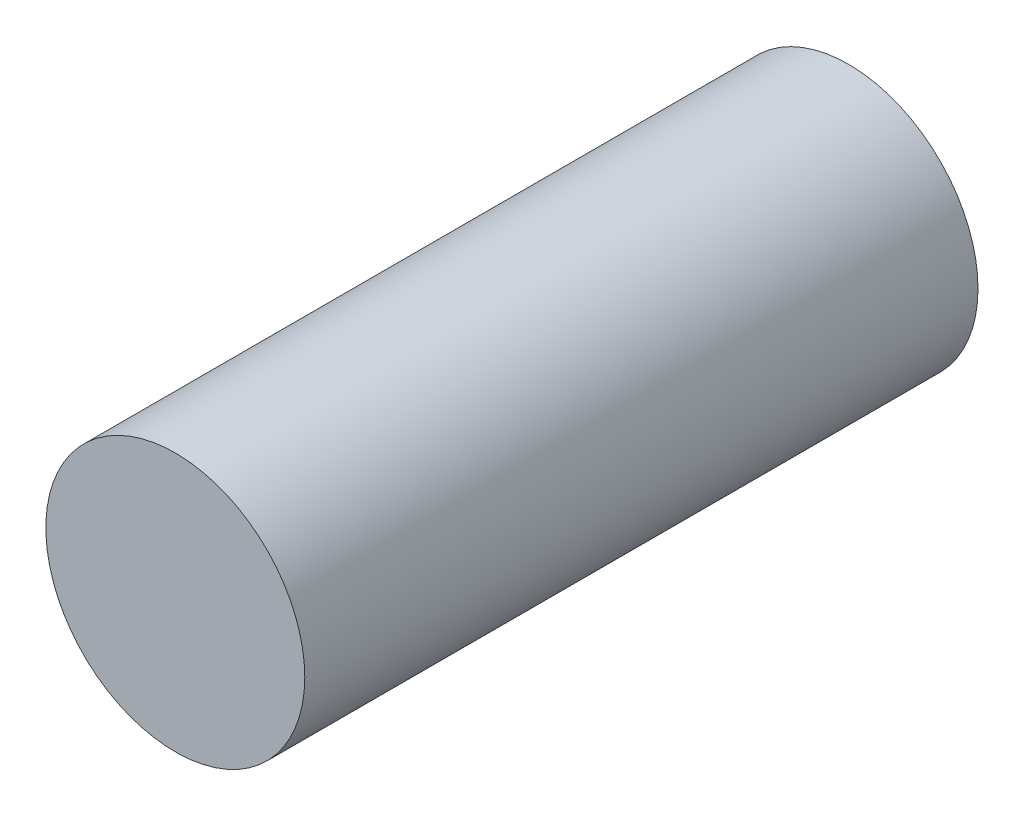
ISO-10303-21;
HEADER;
FILE_DESCRIPTION(('STEP AP214'),'2;1');
FILE_NAME('part.step','',(''),(''),'','','');
FILE_SCHEMA(('AUTOMOTIVE_DESIGN { 1 0 10303 214 1 1 1 1 }'));
ENDSEC;
DATA;
#1=APPLICATION_CONTEXT('core data for automotive mechanical design processes');
#2=APPLICATION_PROTOCOL_DEFINITION('international standard','automotive_design',2000,#1);
#3=PRODUCT_CONTEXT('',#1,'mechanical');
#4=PRODUCT('Part','Part','',(#3));
#5=PRODUCT_RELATED_PRODUCT_CATEGORY('part','',(#4));
#6=PRODUCT_DEFINITION_FORMATION('','',#4);
#7=PRODUCT_DEFINITION_CONTEXT('part definition',#1,'design');
#8=PRODUCT_DEFINITION('design','',#6,#7);
#9=PRODUCT_DEFINITION_SHAPE('','',#8);
#10=(LENGTH_UNIT() NAMED_UNIT(*) SI_UNIT(.MILLI.,.METRE.));
#11=(NAMED_UNIT(*) PLANE_ANGLE_UNIT() SI_UNIT($,.RADIAN.));
#12=(NAMED_UNIT(*) SI_UNIT($,.STERADIAN.) SOLID_ANGLE_UNIT());
#13=UNCERTAINTY_MEASURE_WITH_UNIT(LENGTH_MEASURE(1.E-05),#10,'distance_accuracy_value','');
#14=(GEOMETRIC_REPRESENTATION_CONTEXT(3) GLOBAL_UNCERTAINTY_ASSIGNED_CONTEXT((#13)) GLOBAL_UNIT_ASSIGNED_CONTEXT((#10,
#11,#12)) REPRESENTATION_CONTEXT('',''));
#15=CARTESIAN_POINT('',(0.,0.,0.));
#16=DIRECTION('',(0.,0.,1.));
#17=DIRECTION('',(1.,0.,0.));
#18=AXIS2_PLACEMENT_3D('',#15,#16,#17);
#19=CARTESIAN_POINT('',(0.,0.,26.));
#20=DIRECTION('',(0.,0.,-1.));
#21=DIRECTION('',(-1.,0.,0.));
#22=AXIS2_PLACEMENT_3D('',#19,#20,#21);
#23=CYLINDRICAL_SURFACE('',#22,5.);
#24=CARTESIAN_POINT('',(0.,0.,26.));
#25=DIRECTION('',(0.,0.,1.));
#26=DIRECTION('',(1.,0.,0.));
#27=AXIS2_PLACEMENT_3D('',#24,#25,#26);
#28=CIRCLE('',#27,5.);
#29=CARTESIAN_POINT('',(5.,0.,26.));
#30=VERTEX_POINT('',#29);
#31=EDGE_CURVE('E10',#30,#30,#28,.T.);
#32=ORIENTED_EDGE('',*,*,#31,.F.);
#33=EDGE_LOOP('',(#32));
#34=FACE_BOUND('',#33,.T.);
#35=CARTESIAN_POINT('',(0.,0.,0.));
#36=DIRECTION('',(0.,0.,1.));
#37=DIRECTION('',(1.,0.,0.));
#38=AXIS2_PLACEMENT_3D('',#35,#36,#37);
#39=CIRCLE('',#38,5.);
#40=CARTESIAN_POINT('',(5.,0.,0.));
#41=VERTEX_POINT('',#40);
#42=EDGE_CURVE('E44',#41,#41,#39,.T.);
#43=ORIENTED_EDGE('',*,*,#42,.T.);
#44=EDGE_LOOP('',(#43));
#45=FACE_BOUND('',#44,.T.);
#46=ADVANCED_FACE('F41',(#34,#45),#23,.T.);
#47=CARTESIAN_POINT('',(0.,0.,26.));
#48=DIRECTION('',(0.,0.,1.));
#49=DIRECTION('',(1.,0.,0.));
#50=AXIS2_PLACEMENT_3D('',#47,#48,#49);
#51=PLANE('',#50);
#52=ORIENTED_EDGE('',*,*,#31,.T.);
#53=EDGE_LOOP('',(#52));
#54=FACE_BOUND('',#53,.T.);
#55=ADVANCED_FACE('F58',(#54),#51,.T.);
#56=CARTESIAN_POINT('',(0.,0.,0.));
#57=DIRECTION('',(0.,0.,1.));
#58=DIRECTION('',(1.,0.,0.));
#59=AXIS2_PLACEMENT_3D('',#56,#57,#58);
#60=PLANE('',#59);
#61=ORIENTED_EDGE('',*,*,#42,.F.);
#62=EDGE_LOOP('',(#61));
#63=FACE_BOUND('',#62,.T.);
#64=ADVANCED_FACE('F56',(#63),#60,.F.);
#65=CLOSED_SHELL('',(#46,#55,#64));
#66=MANIFOLD_SOLID_BREP('B2',#65);
#67=ADVANCED_BREP_SHAPE_REPRESENTATION('',(#18,#66),#14);
#68=SHAPE_DEFINITION_REPRESENTATION(#9,#67);
ENDSEC;
END-ISO-10303-21;
